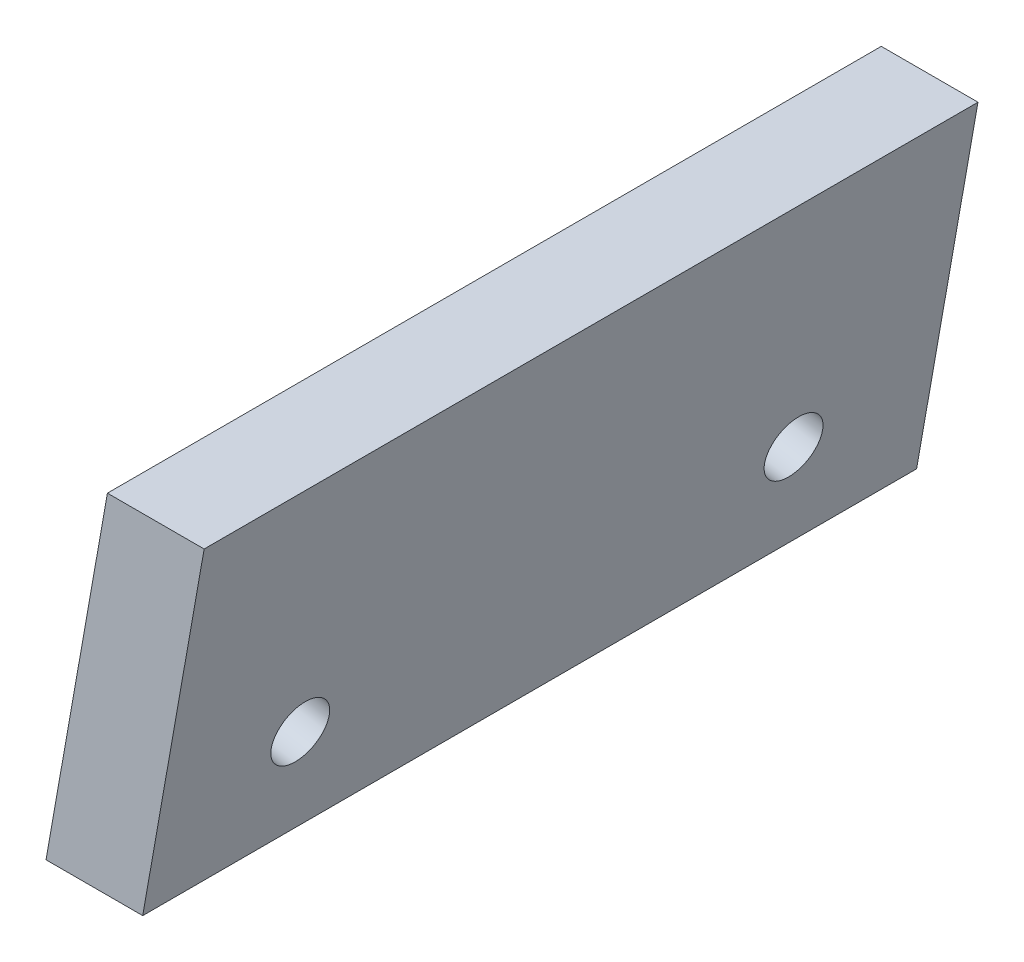
ISO-10303-21;
HEADER;
FILE_DESCRIPTION(('STEP AP214'),'2;1');
FILE_NAME('part.step','',(''),(''),'','','');
FILE_SCHEMA(('AUTOMOTIVE_DESIGN { 1 0 10303 214 1 1 1 1 }'));
ENDSEC;
DATA;
#1=APPLICATION_CONTEXT('core data for automotive mechanical design processes');
#2=APPLICATION_PROTOCOL_DEFINITION('international standard','automotive_design',2000,#1);
#3=PRODUCT_CONTEXT('',#1,'mechanical');
#4=PRODUCT('Part','Part','',(#3));
#5=PRODUCT_RELATED_PRODUCT_CATEGORY('part','',(#4));
#6=PRODUCT_DEFINITION_FORMATION('','',#4);
#7=PRODUCT_DEFINITION_CONTEXT('part definition',#1,'design');
#8=PRODUCT_DEFINITION('design','',#6,#7);
#9=PRODUCT_DEFINITION_SHAPE('','',#8);
#10=(LENGTH_UNIT() NAMED_UNIT(*) SI_UNIT(.MILLI.,.METRE.));
#11=(NAMED_UNIT(*) PLANE_ANGLE_UNIT() SI_UNIT($,.RADIAN.));
#12=(NAMED_UNIT(*) SI_UNIT($,.STERADIAN.) SOLID_ANGLE_UNIT());
#13=UNCERTAINTY_MEASURE_WITH_UNIT(LENGTH_MEASURE(1.E-05),#10,'distance_accuracy_value','');
#14=(GEOMETRIC_REPRESENTATION_CONTEXT(3) GLOBAL_UNCERTAINTY_ASSIGNED_CONTEXT((#13)) GLOBAL_UNIT_ASSIGNED_CONTEXT((#10,
#11,#12)) REPRESENTATION_CONTEXT('',''));
#15=CARTESIAN_POINT('',(0.,0.,0.));
#16=DIRECTION('',(0.,0.,1.));
#17=DIRECTION('',(1.,0.,0.));
#18=AXIS2_PLACEMENT_3D('',#15,#16,#17);
#19=CARTESIAN_POINT('',(0.,0.,20.));
#20=DIRECTION('',(0.984807753012209,-0.173648177666927,0.));
#21=DIRECTION('',(0.173648177666927,0.984807753012209,0.));
#22=AXIS2_PLACEMENT_3D('',#19,#20,#21);
#23=PLANE('',#22);
#24=CARTESIAN_POINT('',(0.520944533000782,2.95442325903663,3.625));
#25=DIRECTION('',(-0.984807753012209,0.173648177666927,0.));
#26=DIRECTION('',(-0.173648177666927,-0.984807753012209,0.));
#27=AXIS2_PLACEMENT_3D('',#24,#25,#26);
#28=CIRCLE('',#27,0.75);
#29=CARTESIAN_POINT('',(0.390708399750586,2.21581744427747,3.625));
#30=VERTEX_POINT('',#29);
#31=EDGE_CURVE('E108',#30,#30,#28,.T.);
#32=ORIENTED_EDGE('',*,*,#31,.F.);
#33=EDGE_LOOP('',(#32));
#34=FACE_BOUND('',#33,.T.);
#35=CARTESIAN_POINT('',(0.520944533000782,2.95442325903663,16.375));
#36=DIRECTION('',(-0.984807753012209,0.173648177666927,0.));
#37=DIRECTION('',(-0.173648177666927,-0.984807753012209,0.));
#38=AXIS2_PLACEMENT_3D('',#35,#36,#37);
#39=CIRCLE('',#38,0.750000000000002);
#40=CARTESIAN_POINT('',(0.390708399750586,2.21581744427747,16.375));
#41=VERTEX_POINT('',#40);
#42=EDGE_CURVE('E113',#41,#41,#39,.T.);
#43=ORIENTED_EDGE('',*,*,#42,.F.);
#44=EDGE_LOOP('',(#43));
#45=FACE_BOUND('',#44,.T.);
#46=DIRECTION('',(-0.173648177666927,-0.984807753012209,0.));
#47=VECTOR('',#46,1.);
#48=CARTESIAN_POINT('',(0.,0.,0.));
#49=LINE('',#48,#47);
#50=CARTESIAN_POINT('',(1.58694282637616,9.,0.));
#51=VERTEX_POINT('',#50);
#52=CARTESIAN_POINT('',(0.,0.,0.));
#53=VERTEX_POINT('',#52);
#54=EDGE_CURVE('E99',#51,#53,#49,.T.);
#55=ORIENTED_EDGE('',*,*,#54,.T.);
#56=DIRECTION('',(0.,0.,-1.));
#57=VECTOR('',#56,1.);
#58=CARTESIAN_POINT('',(0.,0.,20.));
#59=LINE('',#58,#57);
#60=CARTESIAN_POINT('',(0.,0.,20.));
#61=VERTEX_POINT('',#60);
#62=EDGE_CURVE('E11',#61,#53,#59,.T.);
#63=ORIENTED_EDGE('',*,*,#62,.F.);
#64=DIRECTION('',(-0.173648177666927,-0.984807753012209,0.));
#65=VECTOR('',#64,1.);
#66=CARTESIAN_POINT('',(0.,0.,20.));
#67=LINE('',#66,#65);
#68=CARTESIAN_POINT('',(1.58694282637616,9.,20.));
#69=VERTEX_POINT('',#68);
#70=EDGE_CURVE('E86',#69,#61,#67,.T.);
#71=ORIENTED_EDGE('',*,*,#70,.F.);
#72=DIRECTION('',(0.,0.,-1.));
#73=VECTOR('',#72,1.);
#74=CARTESIAN_POINT('',(1.58694282637616,9.,20.));
#75=LINE('',#74,#73);
#76=EDGE_CURVE('E95',#69,#51,#75,.T.);
#77=ORIENTED_EDGE('',*,*,#76,.T.);
#78=EDGE_LOOP('',(#55,#63,#71,#77));
#79=FACE_BOUND('',#78,.T.);
#80=ADVANCED_FACE('F33',(#34,#45,#79),#23,.F.);
#81=CARTESIAN_POINT('',(0.,0.,20.));
#82=DIRECTION('',(0.,1.,0.));
#83=DIRECTION('',(0.,0.,1.));
#84=AXIS2_PLACEMENT_3D('',#81,#82,#83);
#85=PLANE('',#84);
#86=DIRECTION('',(1.,0.,0.));
#87=VECTOR('',#86,1.);
#88=CARTESIAN_POINT('',(0.,0.,0.));
#89=LINE('',#88,#87);
#90=CARTESIAN_POINT('',(2.5,0.,0.));
#91=VERTEX_POINT('',#90);
#92=EDGE_CURVE('E90',#53,#91,#89,.T.);
#93=ORIENTED_EDGE('',*,*,#92,.T.);
#94=DIRECTION('',(0.,0.,-1.));
#95=VECTOR('',#94,1.);
#96=CARTESIAN_POINT('',(2.5,0.,20.));
#97=LINE('',#96,#95);
#98=CARTESIAN_POINT('',(2.5,0.,20.));
#99=VERTEX_POINT('',#98);
#100=EDGE_CURVE('E42',#99,#91,#97,.T.);
#101=ORIENTED_EDGE('',*,*,#100,.F.);
#102=DIRECTION('',(1.,0.,0.));
#103=VECTOR('',#102,1.);
#104=CARTESIAN_POINT('',(0.,0.,20.));
#105=LINE('',#104,#103);
#106=EDGE_CURVE('E81',#61,#99,#105,.T.);
#107=ORIENTED_EDGE('',*,*,#106,.F.);
#108=ORIENTED_EDGE('',*,*,#62,.T.);
#109=EDGE_LOOP('',(#93,#101,#107,#108));
#110=FACE_BOUND('',#109,.T.);
#111=ADVANCED_FACE('F89',(#110),#85,.F.);
#112=CARTESIAN_POINT('',(2.5,0.,20.));
#113=DIRECTION('',(-0.984807753012208,0.173648177666927,0.));
#114=DIRECTION('',(-0.173648177666927,-0.984807753012209,0.));
#115=AXIS2_PLACEMENT_3D('',#112,#113,#114);
#116=PLANE('',#115);
#117=CARTESIAN_POINT('',(2.94556030898317,2.52689807987955,3.625));
#118=DIRECTION('',(-0.984807753012208,0.173648177666927,0.));
#119=DIRECTION('',(-0.173648177666927,-0.984807753012209,0.));
#120=AXIS2_PLACEMENT_3D('',#117,#118,#119);
#121=CIRCLE('',#120,0.75);
#122=CARTESIAN_POINT('',(2.81532417573297,1.78829226512039,3.625));
#123=VERTEX_POINT('',#122);
#124=EDGE_CURVE('E36',#123,#123,#121,.T.);
#125=ORIENTED_EDGE('',*,*,#124,.T.);
#126=EDGE_LOOP('',(#125));
#127=FACE_BOUND('',#126,.T.);
#128=CARTESIAN_POINT('',(2.94556030898317,2.52689807987955,16.375));
#129=DIRECTION('',(-0.984807753012208,0.173648177666927,0.));
#130=DIRECTION('',(-0.173648177666927,-0.984807753012209,0.));
#131=AXIS2_PLACEMENT_3D('',#128,#129,#130);
#132=CIRCLE('',#131,0.750000000000002);
#133=CARTESIAN_POINT('',(2.81532417573297,1.78829226512039,16.375));
#134=VERTEX_POINT('',#133);
#135=EDGE_CURVE('E106',#134,#134,#132,.T.);
#136=ORIENTED_EDGE('',*,*,#135,.T.);
#137=EDGE_LOOP('',(#136));
#138=FACE_BOUND('',#137,.T.);
#139=DIRECTION('',(0.173648177666927,0.984807753012209,0.));
#140=VECTOR('',#139,1.);
#141=CARTESIAN_POINT('',(2.5,0.,0.));
#142=LINE('',#141,#140);
#143=CARTESIAN_POINT('',(4.08694282637616,9.,0.));
#144=VERTEX_POINT('',#143);
#145=EDGE_CURVE('E68',#91,#144,#142,.T.);
#146=ORIENTED_EDGE('',*,*,#145,.T.);
#147=DIRECTION('',(0.,0.,-1.));
#148=VECTOR('',#147,1.);
#149=CARTESIAN_POINT('',(4.08694282637616,9.,20.));
#150=LINE('',#149,#148);
#151=CARTESIAN_POINT('',(4.08694282637616,9.,20.));
#152=VERTEX_POINT('',#151);
#153=EDGE_CURVE('E91',#152,#144,#150,.T.);
#154=ORIENTED_EDGE('',*,*,#153,.F.);
#155=DIRECTION('',(0.173648177666927,0.984807753012209,0.));
#156=VECTOR('',#155,1.);
#157=CARTESIAN_POINT('',(2.5,0.,20.));
#158=LINE('',#157,#156);
#159=EDGE_CURVE('E84',#99,#152,#158,.T.);
#160=ORIENTED_EDGE('',*,*,#159,.F.);
#161=ORIENTED_EDGE('',*,*,#100,.T.);
#162=EDGE_LOOP('',(#146,#154,#160,#161));
#163=FACE_BOUND('',#162,.T.);
#164=ADVANCED_FACE('F93',(#127,#138,#163),#116,.F.);
#165=CARTESIAN_POINT('',(4.08694282637616,9.,20.));
#166=DIRECTION('',(0.,-1.,0.));
#167=DIRECTION('',(1.,0.,0.));
#168=AXIS2_PLACEMENT_3D('',#165,#166,#167);
#169=PLANE('',#168);
#170=DIRECTION('',(-1.,0.,0.));
#171=VECTOR('',#170,1.);
#172=CARTESIAN_POINT('',(4.08694282637616,9.,0.));
#173=LINE('',#172,#171);
#174=EDGE_CURVE('E74',#144,#51,#173,.T.);
#175=ORIENTED_EDGE('',*,*,#174,.T.);
#176=ORIENTED_EDGE('',*,*,#76,.F.);
#177=DIRECTION('',(-1.,0.,0.));
#178=VECTOR('',#177,1.);
#179=CARTESIAN_POINT('',(4.08694282637616,9.,20.));
#180=LINE('',#179,#178);
#181=EDGE_CURVE('E51',#152,#69,#180,.T.);
#182=ORIENTED_EDGE('',*,*,#181,.F.);
#183=ORIENTED_EDGE('',*,*,#153,.T.);
#184=EDGE_LOOP('',(#175,#176,#182,#183));
#185=FACE_BOUND('',#184,.T.);
#186=ADVANCED_FACE('F138',(#185),#169,.F.);
#187=CARTESIAN_POINT('',(0.,0.,20.));
#188=DIRECTION('',(0.,0.,1.));
#189=DIRECTION('',(1.,0.,0.));
#190=AXIS2_PLACEMENT_3D('',#187,#188,#189);
#191=PLANE('',#190);
#192=ORIENTED_EDGE('',*,*,#70,.T.);
#193=ORIENTED_EDGE('',*,*,#106,.T.);
#194=ORIENTED_EDGE('',*,*,#159,.T.);
#195=ORIENTED_EDGE('',*,*,#181,.T.);
#196=EDGE_LOOP('',(#192,#193,#194,#195));
#197=FACE_BOUND('',#196,.T.);
#198=ADVANCED_FACE('F82',(#197),#191,.T.);
#199=CARTESIAN_POINT('',(0.,0.,0.));
#200=DIRECTION('',(0.,0.,1.));
#201=DIRECTION('',(1.,0.,0.));
#202=AXIS2_PLACEMENT_3D('',#199,#200,#201);
#203=PLANE('',#202);
#204=ORIENTED_EDGE('',*,*,#54,.F.);
#205=ORIENTED_EDGE('',*,*,#174,.F.);
#206=ORIENTED_EDGE('',*,*,#145,.F.);
#207=ORIENTED_EDGE('',*,*,#92,.F.);
#208=EDGE_LOOP('',(#204,#205,#206,#207));
#209=FACE_BOUND('',#208,.T.);
#210=ADVANCED_FACE('F129',(#209),#203,.F.);
#211=CARTESIAN_POINT('',(4.48465095394865,2.25551487341614,16.375));
#212=DIRECTION('',(-0.984807753012209,0.173648177666927,0.));
#213=DIRECTION('',(-0.173648177666927,-0.984807753012209,0.));
#214=AXIS2_PLACEMENT_3D('',#211,#212,#213);
#215=CYLINDRICAL_SURFACE('',#214,0.750000000000002);
#216=ORIENTED_EDGE('',*,*,#42,.T.);
#217=EDGE_LOOP('',(#216));
#218=FACE_BOUND('',#217,.T.);
#219=ORIENTED_EDGE('',*,*,#135,.F.);
#220=EDGE_LOOP('',(#219));
#221=FACE_BOUND('',#220,.T.);
#222=ADVANCED_FACE('F121',(#218,#221),#215,.F.);
#223=CARTESIAN_POINT('',(4.48465095394865,2.25551487341614,3.625));
#224=DIRECTION('',(-0.984807753012209,0.173648177666927,0.));
#225=DIRECTION('',(-0.173648177666927,-0.984807753012209,0.));
#226=AXIS2_PLACEMENT_3D('',#223,#224,#225);
#227=CYLINDRICAL_SURFACE('',#226,0.75);
#228=ORIENTED_EDGE('',*,*,#31,.T.);
#229=EDGE_LOOP('',(#228));
#230=FACE_BOUND('',#229,.T.);
#231=ORIENTED_EDGE('',*,*,#124,.F.);
#232=EDGE_LOOP('',(#231));
#233=FACE_BOUND('',#232,.T.);
#234=ADVANCED_FACE('F136',(#230,#233),#227,.F.);
#235=CLOSED_SHELL('',(#80,#111,#164,#186,#198,#210,#222,#234));
#236=MANIFOLD_SOLID_BREP('B2',#235);
#237=ADVANCED_BREP_SHAPE_REPRESENTATION('',(#18,#236),#14);
#238=SHAPE_DEFINITION_REPRESENTATION(#9,#237);
ENDSEC;
END-ISO-10303-21;
